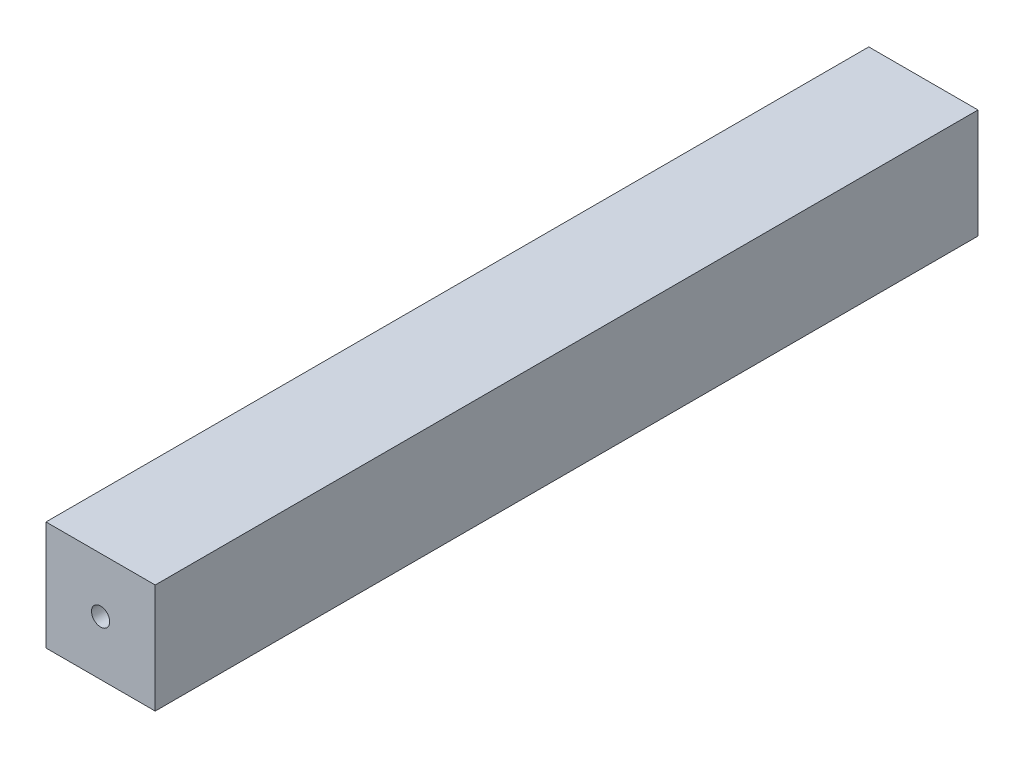
ISO-10303-21;
HEADER;
FILE_DESCRIPTION(('STEP AP214'),'2;1');
FILE_NAME('part.step','',(''),(''),'','','');
FILE_SCHEMA(('AUTOMOTIVE_DESIGN { 1 0 10303 214 1 1 1 1 }'));
ENDSEC;
DATA;
#1=APPLICATION_CONTEXT('core data for automotive mechanical design processes');
#2=APPLICATION_PROTOCOL_DEFINITION('international standard','automotive_design',2000,#1);
#3=PRODUCT_CONTEXT('',#1,'mechanical');
#4=PRODUCT('Part','Part','',(#3));
#5=PRODUCT_RELATED_PRODUCT_CATEGORY('part','',(#4));
#6=PRODUCT_DEFINITION_FORMATION('','',#4);
#7=PRODUCT_DEFINITION_CONTEXT('part definition',#1,'design');
#8=PRODUCT_DEFINITION('design','',#6,#7);
#9=PRODUCT_DEFINITION_SHAPE('','',#8);
#10=(LENGTH_UNIT() NAMED_UNIT(*) SI_UNIT(.MILLI.,.METRE.));
#11=(NAMED_UNIT(*) PLANE_ANGLE_UNIT() SI_UNIT($,.RADIAN.));
#12=(NAMED_UNIT(*) SI_UNIT($,.STERADIAN.) SOLID_ANGLE_UNIT());
#13=UNCERTAINTY_MEASURE_WITH_UNIT(LENGTH_MEASURE(1.E-05),#10,'distance_accuracy_value','');
#14=(GEOMETRIC_REPRESENTATION_CONTEXT(3) GLOBAL_UNCERTAINTY_ASSIGNED_CONTEXT((#13)) GLOBAL_UNIT_ASSIGNED_CONTEXT((#10,
#11,#12)) REPRESENTATION_CONTEXT('',''));
#15=CARTESIAN_POINT('',(0.,0.,0.));
#16=DIRECTION('',(0.,0.,1.));
#17=DIRECTION('',(1.,0.,0.));
#18=AXIS2_PLACEMENT_3D('',#15,#16,#17);
#19=CARTESIAN_POINT('',(0.,0.,113.));
#20=DIRECTION('',(0.,0.,-1.));
#21=DIRECTION('',(-1.,0.,0.));
#22=AXIS2_PLACEMENT_3D('',#19,#20,#21);
#23=PLANE('',#22);
#24=DIRECTION('',(0.,-1.,0.));
#25=VECTOR('',#24,1.);
#26=CARTESIAN_POINT('',(0.,0.,113.));
#27=LINE('',#26,#25);
#28=CARTESIAN_POINT('',(0.,15.,113.));
#29=VERTEX_POINT('',#28);
#30=CARTESIAN_POINT('',(0.,0.,113.));
#31=VERTEX_POINT('',#30);
#32=EDGE_CURVE('E87',#29,#31,#27,.T.);
#33=ORIENTED_EDGE('',*,*,#32,.T.);
#34=DIRECTION('',(1.,0.,0.));
#35=VECTOR('',#34,1.);
#36=CARTESIAN_POINT('',(0.,0.,113.));
#37=LINE('',#36,#35);
#38=CARTESIAN_POINT('',(15.,0.,113.));
#39=VERTEX_POINT('',#38);
#40=EDGE_CURVE('E82',#31,#39,#37,.T.);
#41=ORIENTED_EDGE('',*,*,#40,.T.);
#42=DIRECTION('',(0.,1.,0.));
#43=VECTOR('',#42,1.);
#44=CARTESIAN_POINT('',(15.,0.,113.));
#45=LINE('',#44,#43);
#46=CARTESIAN_POINT('',(15.,15.,113.));
#47=VERTEX_POINT('',#46);
#48=EDGE_CURVE('E85',#39,#47,#45,.T.);
#49=ORIENTED_EDGE('',*,*,#48,.T.);
#50=DIRECTION('',(-1.,0.,0.));
#51=VECTOR('',#50,1.);
#52=CARTESIAN_POINT('',(0.,15.,113.));
#53=LINE('',#52,#51);
#54=EDGE_CURVE('E52',#47,#29,#53,.T.);
#55=ORIENTED_EDGE('',*,*,#54,.T.);
#56=EDGE_LOOP('',(#33,#41,#49,#55));
#57=FACE_BOUND('',#56,.T.);
#58=CARTESIAN_POINT('',(7.5,7.5,113.));
#59=DIRECTION('',(0.,0.,1.));
#60=DIRECTION('',(1.,0.,0.));
#61=AXIS2_PLACEMENT_3D('',#58,#59,#60);
#62=CIRCLE('',#61,1.25);
#63=CARTESIAN_POINT('',(8.75,7.5,113.));
#64=VERTEX_POINT('',#63);
#65=EDGE_CURVE('E102',#64,#64,#62,.T.);
#66=ORIENTED_EDGE('',*,*,#65,.F.);
#67=EDGE_LOOP('',(#66));
#68=FACE_BOUND('',#67,.T.);
#69=ADVANCED_FACE('F35',(#57,#68),#23,.F.);
#70=CARTESIAN_POINT('',(0.,0.,0.));
#71=DIRECTION('',(0.,0.,-1.));
#72=DIRECTION('',(-1.,0.,0.));
#73=AXIS2_PLACEMENT_3D('',#70,#71,#72);
#74=PLANE('',#73);
#75=DIRECTION('',(0.,-1.,0.));
#76=VECTOR('',#75,1.);
#77=CARTESIAN_POINT('',(0.,0.,0.));
#78=LINE('',#77,#76);
#79=CARTESIAN_POINT('',(0.,15.,0.));
#80=VERTEX_POINT('',#79);
#81=CARTESIAN_POINT('',(0.,0.,0.));
#82=VERTEX_POINT('',#81);
#83=EDGE_CURVE('E99',#80,#82,#78,.T.);
#84=ORIENTED_EDGE('',*,*,#83,.F.);
#85=DIRECTION('',(-1.,0.,0.));
#86=VECTOR('',#85,1.);
#87=CARTESIAN_POINT('',(0.,15.,0.));
#88=LINE('',#87,#86);
#89=CARTESIAN_POINT('',(15.,15.,0.));
#90=VERTEX_POINT('',#89);
#91=EDGE_CURVE('E75',#90,#80,#88,.T.);
#92=ORIENTED_EDGE('',*,*,#91,.F.);
#93=DIRECTION('',(0.,1.,0.));
#94=VECTOR('',#93,1.);
#95=CARTESIAN_POINT('',(15.,0.,0.));
#96=LINE('',#95,#94);
#97=CARTESIAN_POINT('',(15.,0.,0.));
#98=VERTEX_POINT('',#97);
#99=EDGE_CURVE('E69',#98,#90,#96,.T.);
#100=ORIENTED_EDGE('',*,*,#99,.F.);
#101=DIRECTION('',(1.,0.,0.));
#102=VECTOR('',#101,1.);
#103=CARTESIAN_POINT('',(0.,0.,0.));
#104=LINE('',#103,#102);
#105=EDGE_CURVE('E91',#82,#98,#104,.T.);
#106=ORIENTED_EDGE('',*,*,#105,.F.);
#107=EDGE_LOOP('',(#84,#92,#100,#106));
#108=FACE_BOUND('',#107,.T.);
#109=CARTESIAN_POINT('',(7.5,7.5,0.));
#110=DIRECTION('',(0.,0.,1.));
#111=DIRECTION('',(1.,0.,0.));
#112=AXIS2_PLACEMENT_3D('',#109,#110,#111);
#113=CIRCLE('',#112,1.25);
#114=CARTESIAN_POINT('',(8.75,7.5,0.));
#115=VERTEX_POINT('',#114);
#116=EDGE_CURVE('E114',#115,#115,#113,.T.);
#117=ORIENTED_EDGE('',*,*,#116,.T.);
#118=EDGE_LOOP('',(#117));
#119=FACE_BOUND('',#118,.T.);
#120=ADVANCED_FACE('F110',(#108,#119),#74,.T.);
#121=CARTESIAN_POINT('',(0.,0.,113.));
#122=DIRECTION('',(1.,0.,0.));
#123=DIRECTION('',(0.,0.,-1.));
#124=AXIS2_PLACEMENT_3D('',#121,#122,#123);
#125=PLANE('',#124);
#126=ORIENTED_EDGE('',*,*,#83,.T.);
#127=DIRECTION('',(0.,0.,-1.));
#128=VECTOR('',#127,1.);
#129=CARTESIAN_POINT('',(0.,0.,113.));
#130=LINE('',#129,#128);
#131=EDGE_CURVE('E11',#31,#82,#130,.T.);
#132=ORIENTED_EDGE('',*,*,#131,.F.);
#133=ORIENTED_EDGE('',*,*,#32,.F.);
#134=DIRECTION('',(0.,0.,-1.));
#135=VECTOR('',#134,1.);
#136=CARTESIAN_POINT('',(0.,15.,113.));
#137=LINE('',#136,#135);
#138=EDGE_CURVE('E95',#29,#80,#137,.T.);
#139=ORIENTED_EDGE('',*,*,#138,.T.);
#140=EDGE_LOOP('',(#126,#132,#133,#139));
#141=FACE_BOUND('',#140,.T.);
#142=ADVANCED_FACE('F37',(#141),#125,.F.);
#143=CARTESIAN_POINT('',(0.,0.,113.));
#144=DIRECTION('',(0.,1.,0.));
#145=DIRECTION('',(0.,0.,1.));
#146=AXIS2_PLACEMENT_3D('',#143,#144,#145);
#147=PLANE('',#146);
#148=ORIENTED_EDGE('',*,*,#105,.T.);
#149=DIRECTION('',(0.,0.,-1.));
#150=VECTOR('',#149,1.);
#151=CARTESIAN_POINT('',(15.,0.,113.));
#152=LINE('',#151,#150);
#153=EDGE_CURVE('E44',#39,#98,#152,.T.);
#154=ORIENTED_EDGE('',*,*,#153,.F.);
#155=ORIENTED_EDGE('',*,*,#40,.F.);
#156=ORIENTED_EDGE('',*,*,#131,.T.);
#157=EDGE_LOOP('',(#148,#154,#155,#156));
#158=FACE_BOUND('',#157,.T.);
#159=ADVANCED_FACE('F90',(#158),#147,.F.);
#160=CARTESIAN_POINT('',(15.,0.,113.));
#161=DIRECTION('',(-1.,0.,0.));
#162=DIRECTION('',(0.,0.,1.));
#163=AXIS2_PLACEMENT_3D('',#160,#161,#162);
#164=PLANE('',#163);
#165=ORIENTED_EDGE('',*,*,#99,.T.);
#166=DIRECTION('',(0.,0.,-1.));
#167=VECTOR('',#166,1.);
#168=CARTESIAN_POINT('',(15.,15.,113.));
#169=LINE('',#168,#167);
#170=EDGE_CURVE('E92',#47,#90,#169,.T.);
#171=ORIENTED_EDGE('',*,*,#170,.F.);
#172=ORIENTED_EDGE('',*,*,#48,.F.);
#173=ORIENTED_EDGE('',*,*,#153,.T.);
#174=EDGE_LOOP('',(#165,#171,#172,#173));
#175=FACE_BOUND('',#174,.T.);
#176=ADVANCED_FACE('F93',(#175),#164,.F.);
#177=CARTESIAN_POINT('',(0.,15.,113.));
#178=DIRECTION('',(0.,-1.,0.));
#179=DIRECTION('',(0.,0.,-1.));
#180=AXIS2_PLACEMENT_3D('',#177,#178,#179);
#181=PLANE('',#180);
#182=ORIENTED_EDGE('',*,*,#91,.T.);
#183=ORIENTED_EDGE('',*,*,#138,.F.);
#184=ORIENTED_EDGE('',*,*,#54,.F.);
#185=ORIENTED_EDGE('',*,*,#170,.T.);
#186=EDGE_LOOP('',(#182,#183,#184,#185));
#187=FACE_BOUND('',#186,.T.);
#188=ADVANCED_FACE('F107',(#187),#181,.F.);
#189=CARTESIAN_POINT('',(7.5,7.5,113.));
#190=DIRECTION('',(0.,0.,-1.));
#191=DIRECTION('',(-1.,0.,0.));
#192=AXIS2_PLACEMENT_3D('',#189,#190,#191);
#193=CYLINDRICAL_SURFACE('',#192,1.25);
#194=ORIENTED_EDGE('',*,*,#65,.T.);
#195=EDGE_LOOP('',(#194));
#196=FACE_BOUND('',#195,.T.);
#197=ORIENTED_EDGE('',*,*,#116,.F.);
#198=EDGE_LOOP('',(#197));
#199=FACE_BOUND('',#198,.T.);
#200=ADVANCED_FACE('F120',(#196,#199),#193,.F.);
#201=CLOSED_SHELL('',(#69,#120,#142,#159,#176,#188,#200));
#202=MANIFOLD_SOLID_BREP('B2',#201);
#203=ADVANCED_BREP_SHAPE_REPRESENTATION('',(#18,#202),#14);
#204=SHAPE_DEFINITION_REPRESENTATION(#9,#203);
ENDSEC;
END-ISO-10303-21;
